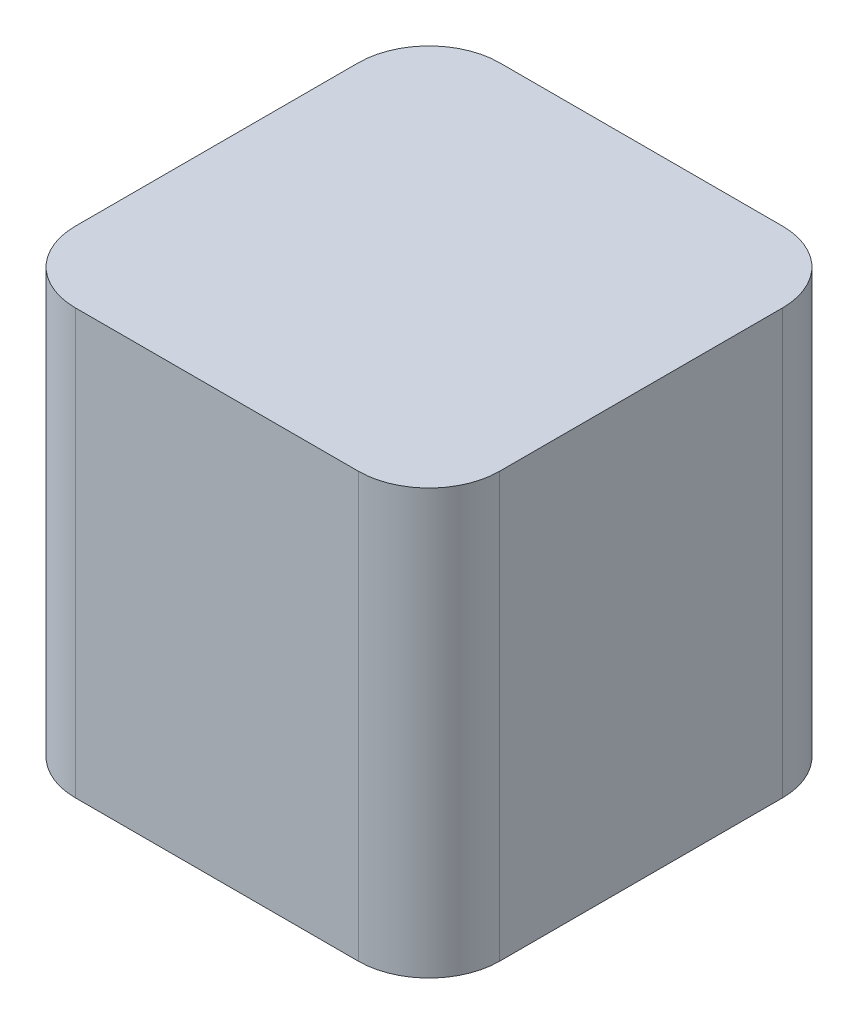
ISO-10303-21;
HEADER;
FILE_DESCRIPTION(('STEP AP214'),'2;1');
FILE_NAME('part.step','',(''),(''),'','','');
FILE_SCHEMA(('AUTOMOTIVE_DESIGN { 1 0 10303 214 1 1 1 1 }'));
ENDSEC;
DATA;
#1=APPLICATION_CONTEXT('core data for automotive mechanical design processes');
#2=APPLICATION_PROTOCOL_DEFINITION('international standard','automotive_design',2000,#1);
#3=PRODUCT_CONTEXT('',#1,'mechanical');
#4=PRODUCT('Part','Part','',(#3));
#5=PRODUCT_RELATED_PRODUCT_CATEGORY('part','',(#4));
#6=PRODUCT_DEFINITION_FORMATION('','',#4);
#7=PRODUCT_DEFINITION_CONTEXT('part definition',#1,'design');
#8=PRODUCT_DEFINITION('design','',#6,#7);
#9=PRODUCT_DEFINITION_SHAPE('','',#8);
#10=(LENGTH_UNIT() NAMED_UNIT(*) SI_UNIT(.MILLI.,.METRE.));
#11=(NAMED_UNIT(*) PLANE_ANGLE_UNIT() SI_UNIT($,.RADIAN.));
#12=(NAMED_UNIT(*) SI_UNIT($,.STERADIAN.) SOLID_ANGLE_UNIT());
#13=UNCERTAINTY_MEASURE_WITH_UNIT(LENGTH_MEASURE(1.E-05),#10,'distance_accuracy_value','');
#14=(GEOMETRIC_REPRESENTATION_CONTEXT(3) GLOBAL_UNCERTAINTY_ASSIGNED_CONTEXT((#13)) GLOBAL_UNIT_ASSIGNED_CONTEXT((#10,
#11,#12)) REPRESENTATION_CONTEXT('',''));
#15=CARTESIAN_POINT('',(0.,0.,0.));
#16=DIRECTION('',(0.,0.,1.));
#17=DIRECTION('',(1.,0.,0.));
#18=AXIS2_PLACEMENT_3D('',#15,#16,#17);
#19=CARTESIAN_POINT('',(15.,30.,-15.));
#20=DIRECTION('',(-1.,0.,0.));
#21=DIRECTION('',(0.,0.,1.));
#22=AXIS2_PLACEMENT_3D('',#19,#20,#21);
#23=PLANE('',#22);
#24=DIRECTION('',(0.,0.,-1.));
#25=VECTOR('',#24,1.);
#26=CARTESIAN_POINT('',(15.,0.,-15.));
#27=LINE('',#26,#25);
#28=CARTESIAN_POINT('',(15.,0.,9.99999999999999));
#29=VERTEX_POINT('',#28);
#30=CARTESIAN_POINT('',(15.,0.,-10.));
#31=VERTEX_POINT('',#30);
#32=EDGE_CURVE('E122',#29,#31,#27,.T.);
#33=ORIENTED_EDGE('',*,*,#32,.T.);
#34=DIRECTION('',(0.,-1.,0.));
#35=VECTOR('',#34,1.);
#36=CARTESIAN_POINT('',(15.,30.,-10.));
#37=LINE('',#36,#35);
#38=CARTESIAN_POINT('',(15.,30.,-10.));
#39=VERTEX_POINT('',#38);
#40=EDGE_CURVE('E156',#31,#39,#37,.F.);
#41=ORIENTED_EDGE('',*,*,#40,.T.);
#42=DIRECTION('',(0.,0.,-1.));
#43=VECTOR('',#42,1.);
#44=CARTESIAN_POINT('',(15.,30.,-15.));
#45=LINE('',#44,#43);
#46=CARTESIAN_POINT('',(15.,30.,9.99999999999999));
#47=VERTEX_POINT('',#46);
#48=EDGE_CURVE('E125',#47,#39,#45,.T.);
#49=ORIENTED_EDGE('',*,*,#48,.F.);
#50=DIRECTION('',(0.,-1.,0.));
#51=VECTOR('',#50,1.);
#52=CARTESIAN_POINT('',(15.,30.,9.99999999999999));
#53=LINE('',#52,#51);
#54=EDGE_CURVE('E112',#47,#29,#53,.T.);
#55=ORIENTED_EDGE('',*,*,#54,.T.);
#56=EDGE_LOOP('',(#33,#41,#49,#55));
#57=FACE_BOUND('',#56,.T.);
#58=ADVANCED_FACE('F41',(#57),#23,.F.);
#59=CARTESIAN_POINT('',(-15.,30.,-15.));
#60=DIRECTION('',(0.,0.,1.));
#61=DIRECTION('',(1.,0.,0.));
#62=AXIS2_PLACEMENT_3D('',#59,#60,#61);
#63=PLANE('',#62);
#64=DIRECTION('',(-1.,0.,0.));
#65=VECTOR('',#64,1.);
#66=CARTESIAN_POINT('',(-15.,0.,-15.));
#67=LINE('',#66,#65);
#68=CARTESIAN_POINT('',(10.,0.,-15.));
#69=VERTEX_POINT('',#68);
#70=CARTESIAN_POINT('',(-10.,0.,-15.));
#71=VERTEX_POINT('',#70);
#72=EDGE_CURVE('E132',#69,#71,#67,.T.);
#73=ORIENTED_EDGE('',*,*,#72,.T.);
#74=DIRECTION('',(0.,-1.,0.));
#75=VECTOR('',#74,1.);
#76=CARTESIAN_POINT('',(-10.,30.,-15.));
#77=LINE('',#76,#75);
#78=CARTESIAN_POINT('',(-10.,30.,-15.));
#79=VERTEX_POINT('',#78);
#80=EDGE_CURVE('E50',#71,#79,#77,.F.);
#81=ORIENTED_EDGE('',*,*,#80,.T.);
#82=DIRECTION('',(-1.,0.,0.));
#83=VECTOR('',#82,1.);
#84=CARTESIAN_POINT('',(-15.,30.,-15.));
#85=LINE('',#84,#83);
#86=CARTESIAN_POINT('',(10.,30.,-15.));
#87=VERTEX_POINT('',#86);
#88=EDGE_CURVE('E187',#87,#79,#85,.T.);
#89=ORIENTED_EDGE('',*,*,#88,.F.);
#90=DIRECTION('',(0.,-1.,0.));
#91=VECTOR('',#90,1.);
#92=CARTESIAN_POINT('',(10.,30.,-15.));
#93=LINE('',#92,#91);
#94=EDGE_CURVE('E150',#87,#69,#93,.T.);
#95=ORIENTED_EDGE('',*,*,#94,.T.);
#96=EDGE_LOOP('',(#73,#81,#89,#95));
#97=FACE_BOUND('',#96,.T.);
#98=ADVANCED_FACE('F197',(#97),#63,.F.);
#99=CARTESIAN_POINT('',(-15.,30.,-15.));
#100=DIRECTION('',(1.,0.,0.));
#101=DIRECTION('',(0.,0.,-1.));
#102=AXIS2_PLACEMENT_3D('',#99,#100,#101);
#103=PLANE('',#102);
#104=DIRECTION('',(0.,0.,1.));
#105=VECTOR('',#104,1.);
#106=CARTESIAN_POINT('',(-15.,30.,-15.));
#107=LINE('',#106,#105);
#108=CARTESIAN_POINT('',(-15.,30.,-10.));
#109=VERTEX_POINT('',#108);
#110=CARTESIAN_POINT('',(-15.,30.,9.99999999999999));
#111=VERTEX_POINT('',#110);
#112=EDGE_CURVE('E185',#109,#111,#107,.T.);
#113=ORIENTED_EDGE('',*,*,#112,.F.);
#114=DIRECTION('',(0.,-1.,0.));
#115=VECTOR('',#114,1.);
#116=CARTESIAN_POINT('',(-15.,30.,-10.));
#117=LINE('',#116,#115);
#118=CARTESIAN_POINT('',(-15.,0.,-10.));
#119=VERTEX_POINT('',#118);
#120=EDGE_CURVE('E177',#109,#119,#117,.T.);
#121=ORIENTED_EDGE('',*,*,#120,.T.);
#122=DIRECTION('',(0.,0.,1.));
#123=VECTOR('',#122,1.);
#124=CARTESIAN_POINT('',(-15.,0.,-15.));
#125=LINE('',#124,#123);
#126=CARTESIAN_POINT('',(-15.,0.,9.99999999999999));
#127=VERTEX_POINT('',#126);
#128=EDGE_CURVE('E135',#119,#127,#125,.T.);
#129=ORIENTED_EDGE('',*,*,#128,.T.);
#130=DIRECTION('',(0.,-1.,0.));
#131=VECTOR('',#130,1.);
#132=CARTESIAN_POINT('',(-15.,30.,9.99999999999999));
#133=LINE('',#132,#131);
#134=EDGE_CURVE('E170',#127,#111,#133,.F.);
#135=ORIENTED_EDGE('',*,*,#134,.T.);
#136=EDGE_LOOP('',(#113,#121,#129,#135));
#137=FACE_BOUND('',#136,.T.);
#138=ADVANCED_FACE('F203',(#137),#103,.F.);
#139=CARTESIAN_POINT('',(-15.,30.,15.));
#140=DIRECTION('',(0.,0.,-1.));
#141=DIRECTION('',(-1.,0.,0.));
#142=AXIS2_PLACEMENT_3D('',#139,#140,#141);
#143=PLANE('',#142);
#144=DIRECTION('',(1.,0.,0.));
#145=VECTOR('',#144,1.);
#146=CARTESIAN_POINT('',(-15.,30.,15.));
#147=LINE('',#146,#145);
#148=CARTESIAN_POINT('',(-10.,30.,15.));
#149=VERTEX_POINT('',#148);
#150=CARTESIAN_POINT('',(10.,30.,15.));
#151=VERTEX_POINT('',#150);
#152=EDGE_CURVE('E127',#149,#151,#147,.T.);
#153=ORIENTED_EDGE('',*,*,#152,.F.);
#154=DIRECTION('',(0.,-1.,0.));
#155=VECTOR('',#154,1.);
#156=CARTESIAN_POINT('',(-10.,30.,15.));
#157=LINE('',#156,#155);
#158=CARTESIAN_POINT('',(-10.,0.,15.));
#159=VERTEX_POINT('',#158);
#160=EDGE_CURVE('E162',#149,#159,#157,.T.);
#161=ORIENTED_EDGE('',*,*,#160,.T.);
#162=DIRECTION('',(1.,0.,0.));
#163=VECTOR('',#162,1.);
#164=CARTESIAN_POINT('',(-15.,0.,15.));
#165=LINE('',#164,#163);
#166=CARTESIAN_POINT('',(10.,0.,15.));
#167=VERTEX_POINT('',#166);
#168=EDGE_CURVE('E142',#159,#167,#165,.T.);
#169=ORIENTED_EDGE('',*,*,#168,.T.);
#170=DIRECTION('',(0.,-1.,0.));
#171=VECTOR('',#170,1.);
#172=CARTESIAN_POINT('',(10.,30.,15.));
#173=LINE('',#172,#171);
#174=EDGE_CURVE('E114',#167,#151,#173,.F.);
#175=ORIENTED_EDGE('',*,*,#174,.T.);
#176=EDGE_LOOP('',(#153,#161,#169,#175));
#177=FACE_BOUND('',#176,.T.);
#178=ADVANCED_FACE('F211',(#177),#143,.F.);
#179=CARTESIAN_POINT('',(0.,30.,0.));
#180=DIRECTION('',(0.,1.,0.));
#181=DIRECTION('',(0.,0.,1.));
#182=AXIS2_PLACEMENT_3D('',#179,#180,#181);
#183=PLANE('',#182);
#184=ORIENTED_EDGE('',*,*,#88,.T.);
#185=CARTESIAN_POINT('',(-10.,30.,-10.));
#186=DIRECTION('',(0.,1.,0.));
#187=DIRECTION('',(0.,0.,1.));
#188=AXIS2_PLACEMENT_3D('',#185,#186,#187);
#189=CIRCLE('',#188,5.);
#190=EDGE_CURVE('E11',#79,#109,#189,.T.);
#191=ORIENTED_EDGE('',*,*,#190,.T.);
#192=ORIENTED_EDGE('',*,*,#112,.T.);
#193=CARTESIAN_POINT('',(-10.,30.,9.99999999999999));
#194=DIRECTION('',(0.,1.,0.));
#195=DIRECTION('',(0.,0.,1.));
#196=AXIS2_PLACEMENT_3D('',#193,#194,#195);
#197=CIRCLE('',#196,5.);
#198=EDGE_CURVE('E174',#111,#149,#197,.T.);
#199=ORIENTED_EDGE('',*,*,#198,.T.);
#200=ORIENTED_EDGE('',*,*,#152,.T.);
#201=CARTESIAN_POINT('',(10.,30.,9.99999999999999));
#202=DIRECTION('',(0.,1.,0.));
#203=DIRECTION('',(0.,0.,1.));
#204=AXIS2_PLACEMENT_3D('',#201,#202,#203);
#205=CIRCLE('',#204,5.);
#206=EDGE_CURVE('E147',#151,#47,#205,.T.);
#207=ORIENTED_EDGE('',*,*,#206,.T.);
#208=ORIENTED_EDGE('',*,*,#48,.T.);
#209=CARTESIAN_POINT('',(10.,30.,-10.));
#210=DIRECTION('',(0.,1.,0.));
#211=DIRECTION('',(0.,0.,1.));
#212=AXIS2_PLACEMENT_3D('',#209,#210,#211);
#213=CIRCLE('',#212,5.);
#214=EDGE_CURVE('E159',#39,#87,#213,.T.);
#215=ORIENTED_EDGE('',*,*,#214,.T.);
#216=EDGE_LOOP('',(#184,#191,#192,#199,#200,#207,#208,#215));
#217=FACE_BOUND('',#216,.T.);
#218=ADVANCED_FACE('F193',(#217),#183,.T.);
#219=CARTESIAN_POINT('',(0.,0.,0.));
#220=DIRECTION('',(0.,1.,0.));
#221=DIRECTION('',(0.,0.,1.));
#222=AXIS2_PLACEMENT_3D('',#219,#220,#221);
#223=PLANE('',#222);
#224=ORIENTED_EDGE('',*,*,#128,.F.);
#225=CARTESIAN_POINT('',(-10.,0.,-10.));
#226=DIRECTION('',(0.,1.,0.));
#227=DIRECTION('',(0.,0.,1.));
#228=AXIS2_PLACEMENT_3D('',#225,#226,#227);
#229=CIRCLE('',#228,5.);
#230=EDGE_CURVE('E64',#119,#71,#229,.F.);
#231=ORIENTED_EDGE('',*,*,#230,.T.);
#232=ORIENTED_EDGE('',*,*,#72,.F.);
#233=CARTESIAN_POINT('',(10.,0.,-10.));
#234=DIRECTION('',(0.,1.,0.));
#235=DIRECTION('',(0.,0.,1.));
#236=AXIS2_PLACEMENT_3D('',#233,#234,#235);
#237=CIRCLE('',#236,5.);
#238=EDGE_CURVE('E130',#69,#31,#237,.F.);
#239=ORIENTED_EDGE('',*,*,#238,.T.);
#240=ORIENTED_EDGE('',*,*,#32,.F.);
#241=CARTESIAN_POINT('',(10.,0.,9.99999999999999));
#242=DIRECTION('',(0.,1.,0.));
#243=DIRECTION('',(0.,0.,1.));
#244=AXIS2_PLACEMENT_3D('',#241,#242,#243);
#245=CIRCLE('',#244,5.);
#246=EDGE_CURVE('E108',#29,#167,#245,.F.);
#247=ORIENTED_EDGE('',*,*,#246,.T.);
#248=ORIENTED_EDGE('',*,*,#168,.F.);
#249=CARTESIAN_POINT('',(-10.,0.,9.99999999999999));
#250=DIRECTION('',(0.,1.,0.));
#251=DIRECTION('',(0.,0.,1.));
#252=AXIS2_PLACEMENT_3D('',#249,#250,#251);
#253=CIRCLE('',#252,5.);
#254=EDGE_CURVE('E166',#159,#127,#253,.F.);
#255=ORIENTED_EDGE('',*,*,#254,.T.);
#256=EDGE_LOOP('',(#224,#231,#232,#239,#240,#247,#248,#255));
#257=FACE_BOUND('',#256,.T.);
#258=ADVANCED_FACE('F129',(#257),#223,.F.);
#259=CARTESIAN_POINT('',(10.,30.,9.99999999999999));
#260=DIRECTION('',(0.,-1.,0.));
#261=DIRECTION('',(0.,0.,-1.));
#262=AXIS2_PLACEMENT_3D('',#259,#260,#261);
#263=CYLINDRICAL_SURFACE('',#262,5.);
#264=ORIENTED_EDGE('',*,*,#206,.F.);
#265=ORIENTED_EDGE('',*,*,#174,.F.);
#266=ORIENTED_EDGE('',*,*,#246,.F.);
#267=ORIENTED_EDGE('',*,*,#54,.F.);
#268=EDGE_LOOP('',(#264,#265,#266,#267));
#269=FACE_BOUND('',#268,.T.);
#270=ADVANCED_FACE('F111',(#269),#263,.T.);
#271=CARTESIAN_POINT('',(10.,30.,-10.));
#272=DIRECTION('',(0.,-1.,0.));
#273=DIRECTION('',(0.,0.,-1.));
#274=AXIS2_PLACEMENT_3D('',#271,#272,#273);
#275=CYLINDRICAL_SURFACE('',#274,5.);
#276=ORIENTED_EDGE('',*,*,#214,.F.);
#277=ORIENTED_EDGE('',*,*,#40,.F.);
#278=ORIENTED_EDGE('',*,*,#238,.F.);
#279=ORIENTED_EDGE('',*,*,#94,.F.);
#280=EDGE_LOOP('',(#276,#277,#278,#279));
#281=FACE_BOUND('',#280,.T.);
#282=ADVANCED_FACE('F196',(#281),#275,.T.);
#283=CARTESIAN_POINT('',(-10.,30.,9.99999999999999));
#284=DIRECTION('',(0.,-1.,0.));
#285=DIRECTION('',(0.,0.,-1.));
#286=AXIS2_PLACEMENT_3D('',#283,#284,#285);
#287=CYLINDRICAL_SURFACE('',#286,5.);
#288=ORIENTED_EDGE('',*,*,#198,.F.);
#289=ORIENTED_EDGE('',*,*,#134,.F.);
#290=ORIENTED_EDGE('',*,*,#254,.F.);
#291=ORIENTED_EDGE('',*,*,#160,.F.);
#292=EDGE_LOOP('',(#288,#289,#290,#291));
#293=FACE_BOUND('',#292,.T.);
#294=ADVANCED_FACE('F208',(#293),#287,.T.);
#295=CARTESIAN_POINT('',(-10.,30.,-10.));
#296=DIRECTION('',(0.,-1.,0.));
#297=DIRECTION('',(0.,0.,-1.));
#298=AXIS2_PLACEMENT_3D('',#295,#296,#297);
#299=CYLINDRICAL_SURFACE('',#298,5.);
#300=ORIENTED_EDGE('',*,*,#190,.F.);
#301=ORIENTED_EDGE('',*,*,#80,.F.);
#302=ORIENTED_EDGE('',*,*,#230,.F.);
#303=ORIENTED_EDGE('',*,*,#120,.F.);
#304=EDGE_LOOP('',(#300,#301,#302,#303));
#305=FACE_BOUND('',#304,.T.);
#306=ADVANCED_FACE('F43',(#305),#299,.T.);
#307=CLOSED_SHELL('',(#58,#98,#138,#178,#218,#258,#270,#282,#294,#306));
#308=MANIFOLD_SOLID_BREP('B2',#307);
#309=ADVANCED_BREP_SHAPE_REPRESENTATION('',(#18,#308),#14);
#310=SHAPE_DEFINITION_REPRESENTATION(#9,#309);
ENDSEC;
END-ISO-10303-21;
